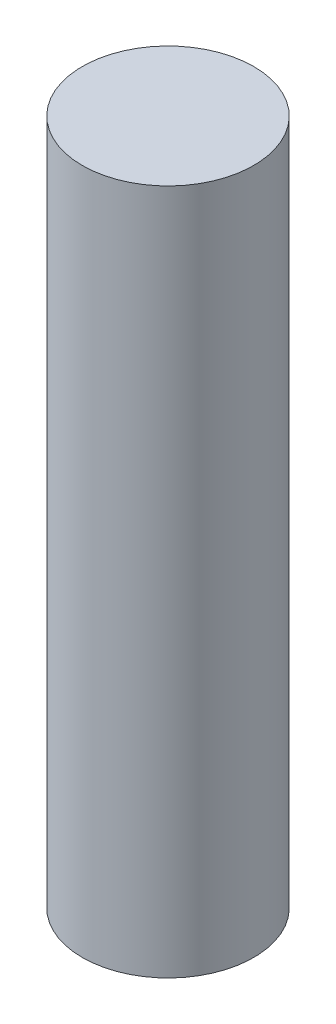
ISO-10303-21;
HEADER;
FILE_DESCRIPTION(('STEP AP214'),'2;1');
FILE_NAME('part.step','',(''),(''),'','','');
FILE_SCHEMA(('AUTOMOTIVE_DESIGN { 1 0 10303 214 1 1 1 1 }'));
ENDSEC;
DATA;
#1=APPLICATION_CONTEXT('core data for automotive mechanical design processes');
#2=APPLICATION_PROTOCOL_DEFINITION('international standard','automotive_design',2000,#1);
#3=PRODUCT_CONTEXT('',#1,'mechanical');
#4=PRODUCT('Part','Part','',(#3));
#5=PRODUCT_RELATED_PRODUCT_CATEGORY('part','',(#4));
#6=PRODUCT_DEFINITION_FORMATION('','',#4);
#7=PRODUCT_DEFINITION_CONTEXT('part definition',#1,'design');
#8=PRODUCT_DEFINITION('design','',#6,#7);
#9=PRODUCT_DEFINITION_SHAPE('','',#8);
#10=(LENGTH_UNIT() NAMED_UNIT(*) SI_UNIT(.MILLI.,.METRE.));
#11=(NAMED_UNIT(*) PLANE_ANGLE_UNIT() SI_UNIT($,.RADIAN.));
#12=(NAMED_UNIT(*) SI_UNIT($,.STERADIAN.) SOLID_ANGLE_UNIT());
#13=UNCERTAINTY_MEASURE_WITH_UNIT(LENGTH_MEASURE(1.E-05),#10,'distance_accuracy_value','');
#14=(GEOMETRIC_REPRESENTATION_CONTEXT(3) GLOBAL_UNCERTAINTY_ASSIGNED_CONTEXT((#13)) GLOBAL_UNIT_ASSIGNED_CONTEXT((#10,
#11,#12)) REPRESENTATION_CONTEXT('',''));
#15=CARTESIAN_POINT('',(0.,0.,0.));
#16=DIRECTION('',(0.,0.,1.));
#17=DIRECTION('',(1.,0.,0.));
#18=AXIS2_PLACEMENT_3D('',#15,#16,#17);
#19=CARTESIAN_POINT('',(0.,160.,0.));
#20=DIRECTION('',(0.,-1.,0.));
#21=DIRECTION('',(0.,0.,-1.));
#22=AXIS2_PLACEMENT_3D('',#19,#20,#21);
#23=CYLINDRICAL_SURFACE('',#22,20.);
#24=CARTESIAN_POINT('',(0.,160.,0.));
#25=DIRECTION('',(0.,1.,0.));
#26=DIRECTION('',(0.,0.,1.));
#27=AXIS2_PLACEMENT_3D('',#24,#25,#26);
#28=CIRCLE('',#27,20.);
#29=CARTESIAN_POINT('',(0.,160.,20.));
#30=VERTEX_POINT('',#29);
#31=EDGE_CURVE('E10',#30,#30,#28,.T.);
#32=ORIENTED_EDGE('',*,*,#31,.F.);
#33=EDGE_LOOP('',(#32));
#34=FACE_BOUND('',#33,.T.);
#35=CARTESIAN_POINT('',(0.,0.,0.));
#36=DIRECTION('',(0.,1.,0.));
#37=DIRECTION('',(0.,0.,1.));
#38=AXIS2_PLACEMENT_3D('',#35,#36,#37);
#39=CIRCLE('',#38,20.);
#40=CARTESIAN_POINT('',(0.,0.,20.));
#41=VERTEX_POINT('',#40);
#42=EDGE_CURVE('E34',#41,#41,#39,.T.);
#43=ORIENTED_EDGE('',*,*,#42,.T.);
#44=EDGE_LOOP('',(#43));
#45=FACE_BOUND('',#44,.T.);
#46=ADVANCED_FACE('F31',(#34,#45),#23,.T.);
#47=CARTESIAN_POINT('',(0.,160.,0.));
#48=DIRECTION('',(0.,1.,0.));
#49=DIRECTION('',(0.,0.,1.));
#50=AXIS2_PLACEMENT_3D('',#47,#48,#49);
#51=PLANE('',#50);
#52=ORIENTED_EDGE('',*,*,#31,.T.);
#53=EDGE_LOOP('',(#52));
#54=FACE_BOUND('',#53,.T.);
#55=ADVANCED_FACE('F46',(#54),#51,.T.);
#56=CARTESIAN_POINT('',(0.,0.,0.));
#57=DIRECTION('',(0.,1.,0.));
#58=DIRECTION('',(0.,0.,1.));
#59=AXIS2_PLACEMENT_3D('',#56,#57,#58);
#60=PLANE('',#59);
#61=ORIENTED_EDGE('',*,*,#42,.F.);
#62=EDGE_LOOP('',(#61));
#63=FACE_BOUND('',#62,.T.);
#64=ADVANCED_FACE('F44',(#63),#60,.F.);
#65=CLOSED_SHELL('',(#46,#55,#64));
#66=MANIFOLD_SOLID_BREP('B2',#65);
#67=ADVANCED_BREP_SHAPE_REPRESENTATION('',(#18,#66),#14);
#68=SHAPE_DEFINITION_REPRESENTATION(#9,#67);
ENDSEC;
END-ISO-10303-21;
